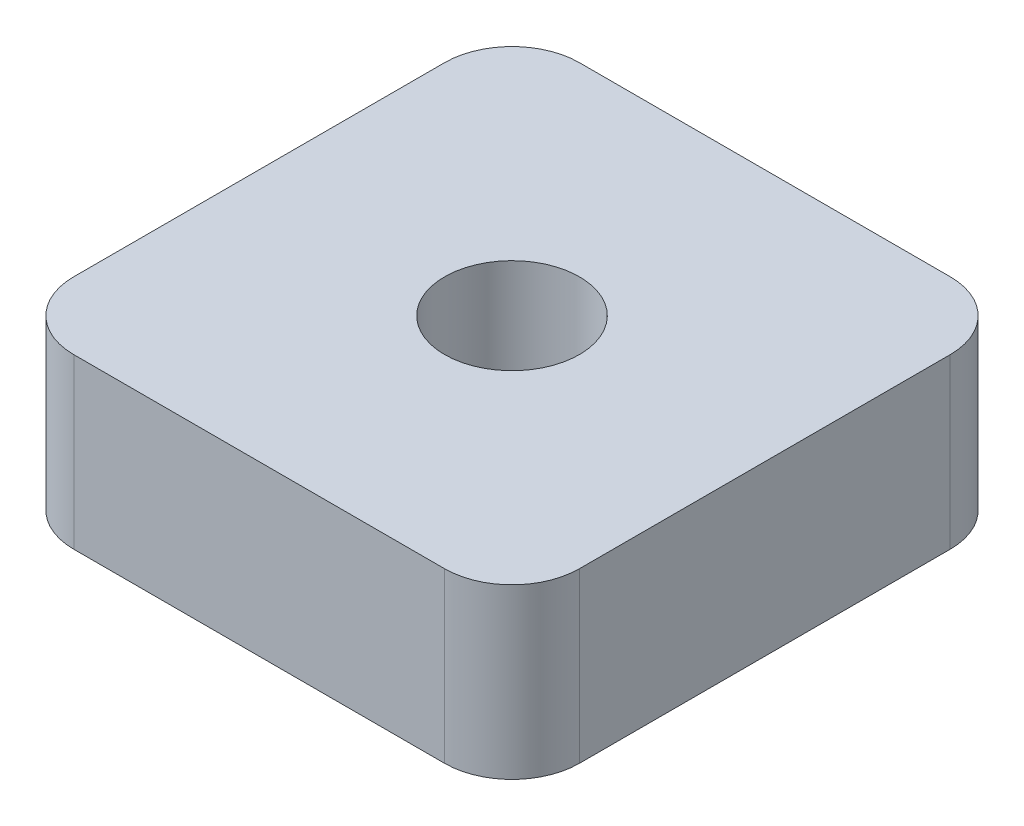
ISO-10303-21;
HEADER;
FILE_DESCRIPTION(('STEP AP214'),'2;1');
FILE_NAME('part.step','',(''),(''),'','','');
FILE_SCHEMA(('AUTOMOTIVE_DESIGN { 1 0 10303 214 1 1 1 1 }'));
ENDSEC;
DATA;
#1=APPLICATION_CONTEXT('core data for automotive mechanical design processes');
#2=APPLICATION_PROTOCOL_DEFINITION('international standard','automotive_design',2000,#1);
#3=PRODUCT_CONTEXT('',#1,'mechanical');
#4=PRODUCT('Part','Part','',(#3));
#5=PRODUCT_RELATED_PRODUCT_CATEGORY('part','',(#4));
#6=PRODUCT_DEFINITION_FORMATION('','',#4);
#7=PRODUCT_DEFINITION_CONTEXT('part definition',#1,'design');
#8=PRODUCT_DEFINITION('design','',#6,#7);
#9=PRODUCT_DEFINITION_SHAPE('','',#8);
#10=(LENGTH_UNIT() NAMED_UNIT(*) SI_UNIT(.MILLI.,.METRE.));
#11=(NAMED_UNIT(*) PLANE_ANGLE_UNIT() SI_UNIT($,.RADIAN.));
#12=(NAMED_UNIT(*) SI_UNIT($,.STERADIAN.) SOLID_ANGLE_UNIT());
#13=UNCERTAINTY_MEASURE_WITH_UNIT(LENGTH_MEASURE(1.E-05),#10,'distance_accuracy_value','');
#14=(GEOMETRIC_REPRESENTATION_CONTEXT(3) GLOBAL_UNCERTAINTY_ASSIGNED_CONTEXT((#13)) GLOBAL_UNIT_ASSIGNED_CONTEXT((#10,
#11,#12)) REPRESENTATION_CONTEXT('',''));
#15=CARTESIAN_POINT('',(0.,0.,0.));
#16=DIRECTION('',(0.,0.,1.));
#17=DIRECTION('',(1.,0.,0.));
#18=AXIS2_PLACEMENT_3D('',#15,#16,#17);
#19=CARTESIAN_POINT('',(-5.5,5.,5.5));
#20=DIRECTION('',(0.,1.,0.));
#21=DIRECTION('',(0.,0.,1.));
#22=AXIS2_PLACEMENT_3D('',#19,#20,#21);
#23=PLANE('',#22);
#24=CARTESIAN_POINT('',(-5.5,5.,5.5));
#25=DIRECTION('',(0.,1.,0.));
#26=DIRECTION('',(0.,0.,1.));
#27=AXIS2_PLACEMENT_3D('',#24,#25,#26);
#28=CIRCLE('',#27,2.);
#29=CARTESIAN_POINT('',(-7.5,5.,5.49999999999999));
#30=VERTEX_POINT('',#29);
#31=CARTESIAN_POINT('',(-5.49999999999999,5.,7.5));
#32=VERTEX_POINT('',#31);
#33=EDGE_CURVE('E145',#30,#32,#28,.T.);
#34=ORIENTED_EDGE('',*,*,#33,.T.);
#35=DIRECTION('',(1.,0.,0.));
#36=VECTOR('',#35,1.);
#37=CARTESIAN_POINT('',(5.49999999999999,5.,7.5));
#38=LINE('',#37,#36);
#39=CARTESIAN_POINT('',(5.49999999999999,5.,7.5));
#40=VERTEX_POINT('',#39);
#41=EDGE_CURVE('E93',#32,#40,#38,.T.);
#42=ORIENTED_EDGE('',*,*,#41,.T.);
#43=CARTESIAN_POINT('',(5.5,5.,5.5));
#44=DIRECTION('',(0.,1.,0.));
#45=DIRECTION('',(0.,0.,-1.));
#46=AXIS2_PLACEMENT_3D('',#43,#44,#45);
#47=CIRCLE('',#46,2.);
#48=CARTESIAN_POINT('',(7.5,5.,5.49999999999999));
#49=VERTEX_POINT('',#48);
#50=EDGE_CURVE('E160',#40,#49,#47,.T.);
#51=ORIENTED_EDGE('',*,*,#50,.T.);
#52=DIRECTION('',(0.,0.,-1.));
#53=VECTOR('',#52,1.);
#54=CARTESIAN_POINT('',(7.5,5.,5.49999999999999));
#55=LINE('',#54,#53);
#56=CARTESIAN_POINT('',(7.5,5.,-5.49999999999999));
#57=VERTEX_POINT('',#56);
#58=EDGE_CURVE('E173',#49,#57,#55,.T.);
#59=ORIENTED_EDGE('',*,*,#58,.T.);
#60=CARTESIAN_POINT('',(5.5,5.,-5.5));
#61=DIRECTION('',(0.,1.,0.));
#62=DIRECTION('',(0.,0.,1.));
#63=AXIS2_PLACEMENT_3D('',#60,#61,#62);
#64=CIRCLE('',#63,2.);
#65=CARTESIAN_POINT('',(5.49999999999999,5.,-7.5));
#66=VERTEX_POINT('',#65);
#67=EDGE_CURVE('E112',#57,#66,#64,.T.);
#68=ORIENTED_EDGE('',*,*,#67,.T.);
#69=DIRECTION('',(-1.,0.,0.));
#70=VECTOR('',#69,1.);
#71=CARTESIAN_POINT('',(5.49999999999999,5.,-7.5));
#72=LINE('',#71,#70);
#73=CARTESIAN_POINT('',(-5.49999999999999,5.,-7.5));
#74=VERTEX_POINT('',#73);
#75=EDGE_CURVE('E106',#66,#74,#72,.T.);
#76=ORIENTED_EDGE('',*,*,#75,.T.);
#77=CARTESIAN_POINT('',(-5.5,5.,-5.5));
#78=DIRECTION('',(0.,1.,0.));
#79=DIRECTION('',(0.,0.,1.));
#80=AXIS2_PLACEMENT_3D('',#77,#78,#79);
#81=CIRCLE('',#80,2.);
#82=CARTESIAN_POINT('',(-7.5,5.,-5.49999999999999));
#83=VERTEX_POINT('',#82);
#84=EDGE_CURVE('E110',#74,#83,#81,.T.);
#85=ORIENTED_EDGE('',*,*,#84,.T.);
#86=DIRECTION('',(0.,0.,1.));
#87=VECTOR('',#86,1.);
#88=CARTESIAN_POINT('',(-7.5,5.,5.49999999999999));
#89=LINE('',#88,#87);
#90=EDGE_CURVE('E50',#83,#30,#89,.T.);
#91=ORIENTED_EDGE('',*,*,#90,.T.);
#92=EDGE_LOOP('',(#34,#42,#51,#59,#68,#76,#85,#91));
#93=FACE_BOUND('',#92,.T.);
#94=CARTESIAN_POINT('',(0.,5.,0.));
#95=DIRECTION('',(0.,1.,0.));
#96=DIRECTION('',(0.,0.,1.));
#97=AXIS2_PLACEMENT_3D('',#94,#95,#96);
#98=CIRCLE('',#97,2.);
#99=CARTESIAN_POINT('',(0.,5.,2.));
#100=VERTEX_POINT('',#99);
#101=EDGE_CURVE('E134',#100,#100,#98,.T.);
#102=ORIENTED_EDGE('',*,*,#101,.F.);
#103=EDGE_LOOP('',(#102));
#104=FACE_BOUND('',#103,.T.);
#105=ADVANCED_FACE('F33',(#93,#104),#23,.T.);
#106=CARTESIAN_POINT('',(-5.5,0.,5.5));
#107=DIRECTION('',(0.,1.,0.));
#108=DIRECTION('',(0.,0.,1.));
#109=AXIS2_PLACEMENT_3D('',#106,#107,#108);
#110=PLANE('',#109);
#111=CARTESIAN_POINT('',(-5.5,0.,5.5));
#112=DIRECTION('',(0.,1.,0.));
#113=DIRECTION('',(0.,0.,1.));
#114=AXIS2_PLACEMENT_3D('',#111,#112,#113);
#115=CIRCLE('',#114,2.);
#116=CARTESIAN_POINT('',(-7.5,0.,5.49999999999999));
#117=VERTEX_POINT('',#116);
#118=CARTESIAN_POINT('',(-5.49999999999999,0.,7.5));
#119=VERTEX_POINT('',#118);
#120=EDGE_CURVE('E130',#117,#119,#115,.T.);
#121=ORIENTED_EDGE('',*,*,#120,.F.);
#122=DIRECTION('',(0.,0.,1.));
#123=VECTOR('',#122,1.);
#124=CARTESIAN_POINT('',(-7.5,0.,5.49999999999999));
#125=LINE('',#124,#123);
#126=CARTESIAN_POINT('',(-7.5,0.,-5.49999999999999));
#127=VERTEX_POINT('',#126);
#128=EDGE_CURVE('E85',#127,#117,#125,.T.);
#129=ORIENTED_EDGE('',*,*,#128,.F.);
#130=CARTESIAN_POINT('',(-5.5,0.,-5.5));
#131=DIRECTION('',(0.,1.,0.));
#132=DIRECTION('',(0.,0.,1.));
#133=AXIS2_PLACEMENT_3D('',#130,#131,#132);
#134=CIRCLE('',#133,2.);
#135=CARTESIAN_POINT('',(-5.49999999999999,0.,-7.5));
#136=VERTEX_POINT('',#135);
#137=EDGE_CURVE('E79',#136,#127,#134,.T.);
#138=ORIENTED_EDGE('',*,*,#137,.F.);
#139=DIRECTION('',(-1.,0.,0.));
#140=VECTOR('',#139,1.);
#141=CARTESIAN_POINT('',(5.49999999999999,0.,-7.5));
#142=LINE('',#141,#140);
#143=CARTESIAN_POINT('',(5.49999999999999,0.,-7.5));
#144=VERTEX_POINT('',#143);
#145=EDGE_CURVE('E120',#144,#136,#142,.T.);
#146=ORIENTED_EDGE('',*,*,#145,.F.);
#147=CARTESIAN_POINT('',(5.5,0.,-5.5));
#148=DIRECTION('',(0.,1.,0.));
#149=DIRECTION('',(0.,0.,1.));
#150=AXIS2_PLACEMENT_3D('',#147,#148,#149);
#151=CIRCLE('',#150,2.);
#152=CARTESIAN_POINT('',(7.5,0.,-5.49999999999999));
#153=VERTEX_POINT('',#152);
#154=EDGE_CURVE('E140',#153,#144,#151,.T.);
#155=ORIENTED_EDGE('',*,*,#154,.F.);
#156=DIRECTION('',(0.,0.,-1.));
#157=VECTOR('',#156,1.);
#158=CARTESIAN_POINT('',(7.5,0.,5.49999999999999));
#159=LINE('',#158,#157);
#160=CARTESIAN_POINT('',(7.5,0.,5.49999999999999));
#161=VERTEX_POINT('',#160);
#162=EDGE_CURVE('E138',#161,#153,#159,.T.);
#163=ORIENTED_EDGE('',*,*,#162,.F.);
#164=CARTESIAN_POINT('',(5.5,0.,5.5));
#165=DIRECTION('',(0.,1.,0.));
#166=DIRECTION('',(0.,0.,-1.));
#167=AXIS2_PLACEMENT_3D('',#164,#165,#166);
#168=CIRCLE('',#167,2.);
#169=CARTESIAN_POINT('',(5.49999999999999,0.,7.5));
#170=VERTEX_POINT('',#169);
#171=EDGE_CURVE('E136',#170,#161,#168,.T.);
#172=ORIENTED_EDGE('',*,*,#171,.F.);
#173=DIRECTION('',(1.,0.,0.));
#174=VECTOR('',#173,1.);
#175=CARTESIAN_POINT('',(5.49999999999999,0.,7.5));
#176=LINE('',#175,#174);
#177=EDGE_CURVE('E133',#119,#170,#176,.T.);
#178=ORIENTED_EDGE('',*,*,#177,.F.);
#179=EDGE_LOOP('',(#121,#129,#138,#146,#155,#163,#172,#178));
#180=FACE_BOUND('',#179,.T.);
#181=CARTESIAN_POINT('',(0.,0.,0.));
#182=DIRECTION('',(0.,1.,0.));
#183=DIRECTION('',(0.,0.,1.));
#184=AXIS2_PLACEMENT_3D('',#181,#182,#183);
#185=CIRCLE('',#184,2.);
#186=CARTESIAN_POINT('',(0.,0.,2.));
#187=VERTEX_POINT('',#186);
#188=EDGE_CURVE('E179',#187,#187,#185,.T.);
#189=ORIENTED_EDGE('',*,*,#188,.T.);
#190=EDGE_LOOP('',(#189));
#191=FACE_BOUND('',#190,.T.);
#192=ADVANCED_FACE('F164',(#180,#191),#110,.F.);
#193=CARTESIAN_POINT('',(-5.5,5.,5.5));
#194=DIRECTION('',(0.,-1.,0.));
#195=DIRECTION('',(0.,0.,-1.));
#196=AXIS2_PLACEMENT_3D('',#193,#194,#195);
#197=CYLINDRICAL_SURFACE('',#196,2.);
#198=ORIENTED_EDGE('',*,*,#120,.T.);
#199=DIRECTION('',(0.,-1.,0.));
#200=VECTOR('',#199,1.);
#201=CARTESIAN_POINT('',(-5.49999999999999,5.,7.5));
#202=LINE('',#201,#200);
#203=EDGE_CURVE('E11',#32,#119,#202,.T.);
#204=ORIENTED_EDGE('',*,*,#203,.F.);
#205=ORIENTED_EDGE('',*,*,#33,.F.);
#206=DIRECTION('',(0.,-1.,0.));
#207=VECTOR('',#206,1.);
#208=CARTESIAN_POINT('',(-7.5,5.,5.49999999999999));
#209=LINE('',#208,#207);
#210=EDGE_CURVE('E126',#30,#117,#209,.T.);
#211=ORIENTED_EDGE('',*,*,#210,.T.);
#212=EDGE_LOOP('',(#198,#204,#205,#211));
#213=FACE_BOUND('',#212,.T.);
#214=ADVANCED_FACE('F35',(#213),#197,.T.);
#215=CARTESIAN_POINT('',(5.49999999999999,5.,7.5));
#216=DIRECTION('',(0.,0.,-1.));
#217=DIRECTION('',(-1.,0.,0.));
#218=AXIS2_PLACEMENT_3D('',#215,#216,#217);
#219=PLANE('',#218);
#220=ORIENTED_EDGE('',*,*,#177,.T.);
#221=DIRECTION('',(0.,-1.,0.));
#222=VECTOR('',#221,1.);
#223=CARTESIAN_POINT('',(5.49999999999999,5.,7.5));
#224=LINE('',#223,#222);
#225=EDGE_CURVE('E42',#40,#170,#224,.T.);
#226=ORIENTED_EDGE('',*,*,#225,.F.);
#227=ORIENTED_EDGE('',*,*,#41,.F.);
#228=ORIENTED_EDGE('',*,*,#203,.T.);
#229=EDGE_LOOP('',(#220,#226,#227,#228));
#230=FACE_BOUND('',#229,.T.);
#231=ADVANCED_FACE('F207',(#230),#219,.F.);
#232=CARTESIAN_POINT('',(5.5,5.,5.5));
#233=DIRECTION('',(0.,-1.,0.));
#234=DIRECTION('',(0.,0.,-1.));
#235=AXIS2_PLACEMENT_3D('',#232,#233,#234);
#236=CYLINDRICAL_SURFACE('',#235,2.);
#237=ORIENTED_EDGE('',*,*,#171,.T.);
#238=DIRECTION('',(0.,-1.,0.));
#239=VECTOR('',#238,1.);
#240=CARTESIAN_POINT('',(7.5,5.,5.49999999999999));
#241=LINE('',#240,#239);
#242=EDGE_CURVE('E152',#49,#161,#241,.T.);
#243=ORIENTED_EDGE('',*,*,#242,.F.);
#244=ORIENTED_EDGE('',*,*,#50,.F.);
#245=ORIENTED_EDGE('',*,*,#225,.T.);
#246=EDGE_LOOP('',(#237,#243,#244,#245));
#247=FACE_BOUND('',#246,.T.);
#248=ADVANCED_FACE('F158',(#247),#236,.T.);
#249=CARTESIAN_POINT('',(7.5,5.,5.49999999999999));
#250=DIRECTION('',(-1.,0.,0.));
#251=DIRECTION('',(0.,0.,1.));
#252=AXIS2_PLACEMENT_3D('',#249,#250,#251);
#253=PLANE('',#252);
#254=ORIENTED_EDGE('',*,*,#162,.T.);
#255=DIRECTION('',(0.,-1.,0.));
#256=VECTOR('',#255,1.);
#257=CARTESIAN_POINT('',(7.5,5.,-5.49999999999999));
#258=LINE('',#257,#256);
#259=EDGE_CURVE('E149',#57,#153,#258,.T.);
#260=ORIENTED_EDGE('',*,*,#259,.F.);
#261=ORIENTED_EDGE('',*,*,#58,.F.);
#262=ORIENTED_EDGE('',*,*,#242,.T.);
#263=EDGE_LOOP('',(#254,#260,#261,#262));
#264=FACE_BOUND('',#263,.T.);
#265=ADVANCED_FACE('F169',(#264),#253,.F.);
#266=CARTESIAN_POINT('',(5.5,5.,-5.5));
#267=DIRECTION('',(0.,-1.,0.));
#268=DIRECTION('',(0.,0.,-1.));
#269=AXIS2_PLACEMENT_3D('',#266,#267,#268);
#270=CYLINDRICAL_SURFACE('',#269,2.);
#271=ORIENTED_EDGE('',*,*,#154,.T.);
#272=DIRECTION('',(0.,-1.,0.));
#273=VECTOR('',#272,1.);
#274=CARTESIAN_POINT('',(5.49999999999999,5.,-7.5));
#275=LINE('',#274,#273);
#276=EDGE_CURVE('E121',#66,#144,#275,.T.);
#277=ORIENTED_EDGE('',*,*,#276,.F.);
#278=ORIENTED_EDGE('',*,*,#67,.F.);
#279=ORIENTED_EDGE('',*,*,#259,.T.);
#280=EDGE_LOOP('',(#271,#277,#278,#279));
#281=FACE_BOUND('',#280,.T.);
#282=ADVANCED_FACE('F172',(#281),#270,.T.);
#283=CARTESIAN_POINT('',(5.49999999999999,5.,-7.5));
#284=DIRECTION('',(0.,0.,1.));
#285=DIRECTION('',(1.,0.,0.));
#286=AXIS2_PLACEMENT_3D('',#283,#284,#285);
#287=PLANE('',#286);
#288=ORIENTED_EDGE('',*,*,#145,.T.);
#289=DIRECTION('',(0.,-1.,0.));
#290=VECTOR('',#289,1.);
#291=CARTESIAN_POINT('',(-5.49999999999999,5.,-7.5));
#292=LINE('',#291,#290);
#293=EDGE_CURVE('E117',#74,#136,#292,.T.);
#294=ORIENTED_EDGE('',*,*,#293,.F.);
#295=ORIENTED_EDGE('',*,*,#75,.F.);
#296=ORIENTED_EDGE('',*,*,#276,.T.);
#297=EDGE_LOOP('',(#288,#294,#295,#296));
#298=FACE_BOUND('',#297,.T.);
#299=ADVANCED_FACE('F118',(#298),#287,.F.);
#300=CARTESIAN_POINT('',(-5.5,5.,-5.5));
#301=DIRECTION('',(0.,-1.,0.));
#302=DIRECTION('',(0.,0.,-1.));
#303=AXIS2_PLACEMENT_3D('',#300,#301,#302);
#304=CYLINDRICAL_SURFACE('',#303,2.);
#305=ORIENTED_EDGE('',*,*,#137,.T.);
#306=DIRECTION('',(0.,-1.,0.));
#307=VECTOR('',#306,1.);
#308=CARTESIAN_POINT('',(-7.5,5.,-5.49999999999999));
#309=LINE('',#308,#307);
#310=EDGE_CURVE('E122',#83,#127,#309,.T.);
#311=ORIENTED_EDGE('',*,*,#310,.F.);
#312=ORIENTED_EDGE('',*,*,#84,.F.);
#313=ORIENTED_EDGE('',*,*,#293,.T.);
#314=EDGE_LOOP('',(#305,#311,#312,#313));
#315=FACE_BOUND('',#314,.T.);
#316=ADVANCED_FACE('F124',(#315),#304,.T.);
#317=CARTESIAN_POINT('',(-7.5,5.,5.49999999999999));
#318=DIRECTION('',(1.,0.,0.));
#319=DIRECTION('',(0.,0.,-1.));
#320=AXIS2_PLACEMENT_3D('',#317,#318,#319);
#321=PLANE('',#320);
#322=ORIENTED_EDGE('',*,*,#128,.T.);
#323=ORIENTED_EDGE('',*,*,#210,.F.);
#324=ORIENTED_EDGE('',*,*,#90,.F.);
#325=ORIENTED_EDGE('',*,*,#310,.T.);
#326=EDGE_LOOP('',(#322,#323,#324,#325));
#327=FACE_BOUND('',#326,.T.);
#328=ADVANCED_FACE('F195',(#327),#321,.F.);
#329=CARTESIAN_POINT('',(0.,5.,0.));
#330=DIRECTION('',(0.,-1.,0.));
#331=DIRECTION('',(0.,0.,-1.));
#332=AXIS2_PLACEMENT_3D('',#329,#330,#331);
#333=CYLINDRICAL_SURFACE('',#332,2.);
#334=ORIENTED_EDGE('',*,*,#101,.T.);
#335=EDGE_LOOP('',(#334));
#336=FACE_BOUND('',#335,.T.);
#337=ORIENTED_EDGE('',*,*,#188,.F.);
#338=EDGE_LOOP('',(#337));
#339=FACE_BOUND('',#338,.T.);
#340=ADVANCED_FACE('F185',(#336,#339),#333,.F.);
#341=CLOSED_SHELL('',(#105,#192,#214,#231,#248,#265,#282,#299,#316,#328,#340));
#342=MANIFOLD_SOLID_BREP('B2',#341);
#343=ADVANCED_BREP_SHAPE_REPRESENTATION('',(#18,#342),#14);
#344=SHAPE_DEFINITION_REPRESENTATION(#9,#343);
ENDSEC;
END-ISO-10303-21;
